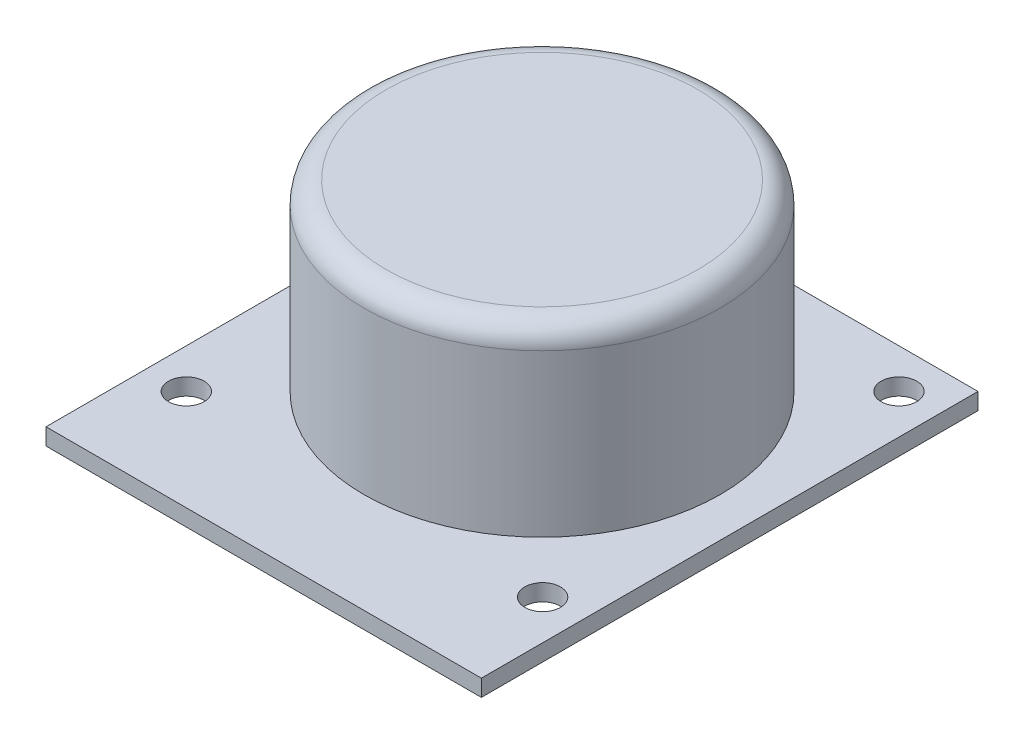
ISO-10303-21;
HEADER;
FILE_DESCRIPTION(('STEP AP214'),'2;1');
FILE_NAME('part.step','',(''),(''),'','','');
FILE_SCHEMA(('AUTOMOTIVE_DESIGN { 1 0 10303 214 1 1 1 1 }'));
ENDSEC;
DATA;
#1=APPLICATION_CONTEXT('core data for automotive mechanical design processes');
#2=APPLICATION_PROTOCOL_DEFINITION('international standard','automotive_design',2000,#1);
#3=PRODUCT_CONTEXT('',#1,'mechanical');
#4=PRODUCT('Part','Part','',(#3));
#5=PRODUCT_RELATED_PRODUCT_CATEGORY('part','',(#4));
#6=PRODUCT_DEFINITION_FORMATION('','',#4);
#7=PRODUCT_DEFINITION_CONTEXT('part definition',#1,'design');
#8=PRODUCT_DEFINITION('design','',#6,#7);
#9=PRODUCT_DEFINITION_SHAPE('','',#8);
#10=(LENGTH_UNIT() NAMED_UNIT(*) SI_UNIT(.MILLI.,.METRE.));
#11=(NAMED_UNIT(*) PLANE_ANGLE_UNIT() SI_UNIT($,.RADIAN.));
#12=(NAMED_UNIT(*) SI_UNIT($,.STERADIAN.) SOLID_ANGLE_UNIT());
#13=UNCERTAINTY_MEASURE_WITH_UNIT(LENGTH_MEASURE(1.E-05),#10,'distance_accuracy_value','');
#14=(GEOMETRIC_REPRESENTATION_CONTEXT(3) GLOBAL_UNCERTAINTY_ASSIGNED_CONTEXT((#13)) GLOBAL_UNIT_ASSIGNED_CONTEXT((#10,
#11,#12)) REPRESENTATION_CONTEXT('',''));
#15=CARTESIAN_POINT('',(0.,0.,0.));
#16=DIRECTION('',(0.,0.,1.));
#17=DIRECTION('',(1.,0.,0.));
#18=AXIS2_PLACEMENT_3D('',#15,#16,#17);
#19=CARTESIAN_POINT('',(39.1,1.5,0.));
#20=DIRECTION('',(0.,0.,-1.));
#21=DIRECTION('',(-1.,0.,0.));
#22=AXIS2_PLACEMENT_3D('',#19,#20,#21);
#23=PLANE('',#22);
#24=DIRECTION('',(1.,0.,0.));
#25=VECTOR('',#24,1.);
#26=CARTESIAN_POINT('',(39.1,0.,0.));
#27=LINE('',#26,#25);
#28=CARTESIAN_POINT('',(0.,0.,0.));
#29=VERTEX_POINT('',#28);
#30=CARTESIAN_POINT('',(39.1,0.,0.));
#31=VERTEX_POINT('',#30);
#32=EDGE_CURVE('E101',#29,#31,#27,.T.);
#33=ORIENTED_EDGE('',*,*,#32,.T.);
#34=DIRECTION('',(0.,-1.,0.));
#35=VECTOR('',#34,1.);
#36=CARTESIAN_POINT('',(39.1,1.5,0.));
#37=LINE('',#36,#35);
#38=CARTESIAN_POINT('',(39.1,1.5,0.));
#39=VERTEX_POINT('',#38);
#40=EDGE_CURVE('E92',#39,#31,#37,.T.);
#41=ORIENTED_EDGE('',*,*,#40,.F.);
#42=DIRECTION('',(1.,0.,0.));
#43=VECTOR('',#42,1.);
#44=CARTESIAN_POINT('',(39.1,1.5,0.));
#45=LINE('',#44,#43);
#46=CARTESIAN_POINT('',(0.,1.5,0.));
#47=VERTEX_POINT('',#46);
#48=EDGE_CURVE('E86',#47,#39,#45,.T.);
#49=ORIENTED_EDGE('',*,*,#48,.F.);
#50=DIRECTION('',(0.,-1.,0.));
#51=VECTOR('',#50,1.);
#52=CARTESIAN_POINT('',(0.,1.5,0.));
#53=LINE('',#52,#51);
#54=EDGE_CURVE('E97',#47,#29,#53,.T.);
#55=ORIENTED_EDGE('',*,*,#54,.T.);
#56=EDGE_LOOP('',(#33,#41,#49,#55));
#57=FACE_BOUND('',#56,.T.);
#58=ADVANCED_FACE('F33',(#57),#23,.F.);
#59=CARTESIAN_POINT('',(39.1,1.5,-44.6));
#60=DIRECTION('',(-1.,0.,0.));
#61=DIRECTION('',(0.,0.,1.));
#62=AXIS2_PLACEMENT_3D('',#59,#60,#61);
#63=PLANE('',#62);
#64=DIRECTION('',(0.,0.,-1.));
#65=VECTOR('',#64,1.);
#66=CARTESIAN_POINT('',(39.1,0.,-44.6));
#67=LINE('',#66,#65);
#68=CARTESIAN_POINT('',(39.1,0.,-44.6));
#69=VERTEX_POINT('',#68);
#70=EDGE_CURVE('E91',#31,#69,#67,.T.);
#71=ORIENTED_EDGE('',*,*,#70,.T.);
#72=DIRECTION('',(0.,-1.,0.));
#73=VECTOR('',#72,1.);
#74=CARTESIAN_POINT('',(39.1,1.5,-44.6));
#75=LINE('',#74,#73);
#76=CARTESIAN_POINT('',(39.1,1.5,-44.6));
#77=VERTEX_POINT('',#76);
#78=EDGE_CURVE('E89',#77,#69,#75,.T.);
#79=ORIENTED_EDGE('',*,*,#78,.F.);
#80=DIRECTION('',(0.,0.,-1.));
#81=VECTOR('',#80,1.);
#82=CARTESIAN_POINT('',(39.1,1.5,-44.6));
#83=LINE('',#82,#81);
#84=EDGE_CURVE('E81',#39,#77,#83,.T.);
#85=ORIENTED_EDGE('',*,*,#84,.F.);
#86=ORIENTED_EDGE('',*,*,#40,.T.);
#87=EDGE_LOOP('',(#71,#79,#85,#86));
#88=FACE_BOUND('',#87,.T.);
#89=ADVANCED_FACE('F90',(#88),#63,.F.);
#90=CARTESIAN_POINT('',(0.,1.5,-44.6));
#91=DIRECTION('',(0.,0.,1.));
#92=DIRECTION('',(1.,0.,0.));
#93=AXIS2_PLACEMENT_3D('',#90,#91,#92);
#94=PLANE('',#93);
#95=DIRECTION('',(-1.,0.,0.));
#96=VECTOR('',#95,1.);
#97=CARTESIAN_POINT('',(0.,0.,-44.6));
#98=LINE('',#97,#96);
#99=CARTESIAN_POINT('',(0.,0.,-44.6));
#100=VERTEX_POINT('',#99);
#101=EDGE_CURVE('E67',#69,#100,#98,.T.);
#102=ORIENTED_EDGE('',*,*,#101,.T.);
#103=DIRECTION('',(0.,-1.,0.));
#104=VECTOR('',#103,1.);
#105=CARTESIAN_POINT('',(0.,1.5,-44.6));
#106=LINE('',#105,#104);
#107=CARTESIAN_POINT('',(0.,1.5,-44.6));
#108=VERTEX_POINT('',#107);
#109=EDGE_CURVE('E93',#108,#100,#106,.T.);
#110=ORIENTED_EDGE('',*,*,#109,.F.);
#111=DIRECTION('',(-1.,0.,0.));
#112=VECTOR('',#111,1.);
#113=CARTESIAN_POINT('',(0.,1.5,-44.6));
#114=LINE('',#113,#112);
#115=EDGE_CURVE('E84',#77,#108,#114,.T.);
#116=ORIENTED_EDGE('',*,*,#115,.F.);
#117=ORIENTED_EDGE('',*,*,#78,.T.);
#118=EDGE_LOOP('',(#102,#110,#116,#117));
#119=FACE_BOUND('',#118,.T.);
#120=ADVANCED_FACE('F95',(#119),#94,.F.);
#121=CARTESIAN_POINT('',(0.,1.5,0.));
#122=DIRECTION('',(1.,0.,0.));
#123=DIRECTION('',(0.,0.,-1.));
#124=AXIS2_PLACEMENT_3D('',#121,#122,#123);
#125=PLANE('',#124);
#126=DIRECTION('',(0.,0.,1.));
#127=VECTOR('',#126,1.);
#128=CARTESIAN_POINT('',(0.,0.,0.));
#129=LINE('',#128,#127);
#130=EDGE_CURVE('E73',#100,#29,#129,.T.);
#131=ORIENTED_EDGE('',*,*,#130,.T.);
#132=ORIENTED_EDGE('',*,*,#54,.F.);
#133=DIRECTION('',(0.,0.,1.));
#134=VECTOR('',#133,1.);
#135=CARTESIAN_POINT('',(0.,1.5,0.));
#136=LINE('',#135,#134);
#137=EDGE_CURVE('E50',#108,#47,#136,.T.);
#138=ORIENTED_EDGE('',*,*,#137,.F.);
#139=ORIENTED_EDGE('',*,*,#109,.T.);
#140=EDGE_LOOP('',(#131,#132,#138,#139));
#141=FACE_BOUND('',#140,.T.);
#142=ADVANCED_FACE('F135',(#141),#125,.F.);
#143=CARTESIAN_POINT('',(0.,1.5,0.));
#144=DIRECTION('',(0.,-1.,0.));
#145=DIRECTION('',(0.,0.,-1.));
#146=AXIS2_PLACEMENT_3D('',#143,#144,#145);
#147=PLANE('',#146);
#148=CARTESIAN_POINT('',(19.55,1.5,-25.));
#149=DIRECTION('',(0.,-1.,0.));
#150=DIRECTION('',(0.,0.,-1.));
#151=AXIS2_PLACEMENT_3D('',#148,#149,#150);
#152=CIRCLE('',#151,16.);
#153=CARTESIAN_POINT('',(19.55,1.5,-41.));
#154=VERTEX_POINT('',#153);
#155=EDGE_CURVE('E111',#154,#154,#152,.F.);
#156=ORIENTED_EDGE('',*,*,#155,.F.);
#157=EDGE_LOOP('',(#156));
#158=FACE_BOUND('',#157,.T.);
#159=CARTESIAN_POINT('',(3.55,1.5,-9.05));
#160=DIRECTION('',(0.,1.,0.));
#161=DIRECTION('',(0.,0.,-1.));
#162=AXIS2_PLACEMENT_3D('',#159,#160,#161);
#163=CIRCLE('',#162,1.6);
#164=CARTESIAN_POINT('',(3.55,1.5,-10.65));
#165=VERTEX_POINT('',#164);
#166=EDGE_CURVE('E171',#165,#165,#163,.T.);
#167=ORIENTED_EDGE('',*,*,#166,.F.);
#168=EDGE_LOOP('',(#167));
#169=FACE_BOUND('',#168,.T.);
#170=CARTESIAN_POINT('',(3.54999999999999,1.5,-41.05));
#171=DIRECTION('',(0.,1.,0.));
#172=DIRECTION('',(0.,0.,1.));
#173=AXIS2_PLACEMENT_3D('',#170,#171,#172);
#174=CIRCLE('',#173,1.6);
#175=CARTESIAN_POINT('',(3.54999999999999,1.5,-39.45));
#176=VERTEX_POINT('',#175);
#177=EDGE_CURVE('E175',#176,#176,#174,.T.);
#178=ORIENTED_EDGE('',*,*,#177,.F.);
#179=EDGE_LOOP('',(#178));
#180=FACE_BOUND('',#179,.T.);
#181=CARTESIAN_POINT('',(35.55,1.5,-41.05));
#182=DIRECTION('',(0.,1.,0.));
#183=DIRECTION('',(0.,0.,-1.));
#184=AXIS2_PLACEMENT_3D('',#181,#182,#183);
#185=CIRCLE('',#184,1.6);
#186=CARTESIAN_POINT('',(35.55,1.5,-42.65));
#187=VERTEX_POINT('',#186);
#188=EDGE_CURVE('E179',#187,#187,#185,.T.);
#189=ORIENTED_EDGE('',*,*,#188,.F.);
#190=EDGE_LOOP('',(#189));
#191=FACE_BOUND('',#190,.T.);
#192=CARTESIAN_POINT('',(35.55,1.5,-9.05));
#193=DIRECTION('',(0.,1.,0.));
#194=DIRECTION('',(0.,0.,1.));
#195=AXIS2_PLACEMENT_3D('',#192,#193,#194);
#196=CIRCLE('',#195,1.6);
#197=CARTESIAN_POINT('',(35.55,1.5,-7.45));
#198=VERTEX_POINT('',#197);
#199=EDGE_CURVE('E182',#198,#198,#196,.T.);
#200=ORIENTED_EDGE('',*,*,#199,.F.);
#201=EDGE_LOOP('',(#200));
#202=FACE_BOUND('',#201,.T.);
#203=ORIENTED_EDGE('',*,*,#48,.T.);
#204=ORIENTED_EDGE('',*,*,#84,.T.);
#205=ORIENTED_EDGE('',*,*,#115,.T.);
#206=ORIENTED_EDGE('',*,*,#137,.T.);
#207=EDGE_LOOP('',(#203,#204,#205,#206));
#208=FACE_BOUND('',#207,.T.);
#209=ADVANCED_FACE('F82',(#158,#169,#180,#191,#202,#208),#147,.F.);
#210=CARTESIAN_POINT('',(0.,0.,0.));
#211=DIRECTION('',(0.,-1.,0.));
#212=DIRECTION('',(0.,0.,-1.));
#213=AXIS2_PLACEMENT_3D('',#210,#211,#212);
#214=PLANE('',#213);
#215=CARTESIAN_POINT('',(3.55,0.,-9.05));
#216=DIRECTION('',(0.,1.,0.));
#217=DIRECTION('',(0.,0.,-1.));
#218=AXIS2_PLACEMENT_3D('',#215,#216,#217);
#219=CIRCLE('',#218,1.6);
#220=CARTESIAN_POINT('',(3.55,0.,-10.65));
#221=VERTEX_POINT('',#220);
#222=EDGE_CURVE('E192',#221,#221,#219,.T.);
#223=ORIENTED_EDGE('',*,*,#222,.T.);
#224=EDGE_LOOP('',(#223));
#225=FACE_BOUND('',#224,.T.);
#226=CARTESIAN_POINT('',(3.54999999999999,0.,-41.05));
#227=DIRECTION('',(0.,1.,0.));
#228=DIRECTION('',(0.,0.,1.));
#229=AXIS2_PLACEMENT_3D('',#226,#227,#228);
#230=CIRCLE('',#229,1.6);
#231=CARTESIAN_POINT('',(3.54999999999999,0.,-39.45));
#232=VERTEX_POINT('',#231);
#233=EDGE_CURVE('E196',#232,#232,#230,.T.);
#234=ORIENTED_EDGE('',*,*,#233,.T.);
#235=EDGE_LOOP('',(#234));
#236=FACE_BOUND('',#235,.T.);
#237=CARTESIAN_POINT('',(35.55,0.,-41.05));
#238=DIRECTION('',(0.,1.,0.));
#239=DIRECTION('',(0.,0.,-1.));
#240=AXIS2_PLACEMENT_3D('',#237,#238,#239);
#241=CIRCLE('',#240,1.6);
#242=CARTESIAN_POINT('',(35.55,0.,-42.65));
#243=VERTEX_POINT('',#242);
#244=EDGE_CURVE('E184',#243,#243,#241,.T.);
#245=ORIENTED_EDGE('',*,*,#244,.T.);
#246=EDGE_LOOP('',(#245));
#247=FACE_BOUND('',#246,.T.);
#248=CARTESIAN_POINT('',(35.55,0.,-9.05));
#249=DIRECTION('',(0.,1.,0.));
#250=DIRECTION('',(0.,0.,1.));
#251=AXIS2_PLACEMENT_3D('',#248,#249,#250);
#252=CIRCLE('',#251,1.6);
#253=CARTESIAN_POINT('',(35.55,0.,-7.45));
#254=VERTEX_POINT('',#253);
#255=EDGE_CURVE('E104',#254,#254,#252,.T.);
#256=ORIENTED_EDGE('',*,*,#255,.T.);
#257=EDGE_LOOP('',(#256));
#258=FACE_BOUND('',#257,.T.);
#259=ORIENTED_EDGE('',*,*,#32,.F.);
#260=ORIENTED_EDGE('',*,*,#130,.F.);
#261=ORIENTED_EDGE('',*,*,#101,.F.);
#262=ORIENTED_EDGE('',*,*,#70,.F.);
#263=EDGE_LOOP('',(#259,#260,#261,#262));
#264=FACE_BOUND('',#263,.T.);
#265=ADVANCED_FACE('F138',(#225,#236,#247,#258,#264),#214,.T.);
#266=CARTESIAN_POINT('',(35.55,0.,-9.05));
#267=DIRECTION('',(0.,1.,0.));
#268=DIRECTION('',(0.,0.,1.));
#269=AXIS2_PLACEMENT_3D('',#266,#267,#268);
#270=CYLINDRICAL_SURFACE('',#269,1.6);
#271=ORIENTED_EDGE('',*,*,#255,.F.);
#272=EDGE_LOOP('',(#271));
#273=FACE_BOUND('',#272,.T.);
#274=ORIENTED_EDGE('',*,*,#199,.T.);
#275=EDGE_LOOP('',(#274));
#276=FACE_BOUND('',#275,.T.);
#277=ADVANCED_FACE('F141',(#273,#276),#270,.F.);
#278=CARTESIAN_POINT('',(35.55,0.,-41.05));
#279=DIRECTION('',(0.,1.,0.));
#280=DIRECTION('',(0.,0.,1.));
#281=AXIS2_PLACEMENT_3D('',#278,#279,#280);
#282=CYLINDRICAL_SURFACE('',#281,1.6);
#283=ORIENTED_EDGE('',*,*,#244,.F.);
#284=EDGE_LOOP('',(#283));
#285=FACE_BOUND('',#284,.T.);
#286=ORIENTED_EDGE('',*,*,#188,.T.);
#287=EDGE_LOOP('',(#286));
#288=FACE_BOUND('',#287,.T.);
#289=ADVANCED_FACE('F148',(#285,#288),#282,.F.);
#290=CARTESIAN_POINT('',(3.54999999999999,0.,-41.05));
#291=DIRECTION('',(0.,1.,0.));
#292=DIRECTION('',(0.,0.,1.));
#293=AXIS2_PLACEMENT_3D('',#290,#291,#292);
#294=CYLINDRICAL_SURFACE('',#293,1.6);
#295=ORIENTED_EDGE('',*,*,#233,.F.);
#296=EDGE_LOOP('',(#295));
#297=FACE_BOUND('',#296,.T.);
#298=ORIENTED_EDGE('',*,*,#177,.T.);
#299=EDGE_LOOP('',(#298));
#300=FACE_BOUND('',#299,.T.);
#301=ADVANCED_FACE('F153',(#297,#300),#294,.F.);
#302=CARTESIAN_POINT('',(3.55,0.,-9.05));
#303=DIRECTION('',(0.,1.,0.));
#304=DIRECTION('',(0.,0.,1.));
#305=AXIS2_PLACEMENT_3D('',#302,#303,#304);
#306=CYLINDRICAL_SURFACE('',#305,1.6);
#307=ORIENTED_EDGE('',*,*,#222,.F.);
#308=EDGE_LOOP('',(#307));
#309=FACE_BOUND('',#308,.T.);
#310=ORIENTED_EDGE('',*,*,#166,.T.);
#311=EDGE_LOOP('',(#310));
#312=FACE_BOUND('',#311,.T.);
#313=ADVANCED_FACE('F150',(#309,#312),#306,.F.);
#314=CARTESIAN_POINT('',(19.55,18.,-25.));
#315=DIRECTION('',(0.,-1.,0.));
#316=DIRECTION('',(0.,0.,-1.));
#317=AXIS2_PLACEMENT_3D('',#314,#315,#316);
#318=CYLINDRICAL_SURFACE('',#317,16.);
#319=CARTESIAN_POINT('',(19.55,16.,-25.));
#320=DIRECTION('',(0.,1.,0.));
#321=DIRECTION('',(0.,0.,1.));
#322=AXIS2_PLACEMENT_3D('',#319,#320,#321);
#323=CIRCLE('',#322,16.);
#324=CARTESIAN_POINT('',(19.55,16.,-9.));
#325=VERTEX_POINT('',#324);
#326=EDGE_CURVE('E11',#325,#325,#323,.F.);
#327=ORIENTED_EDGE('',*,*,#326,.T.);
#328=EDGE_LOOP('',(#327));
#329=FACE_BOUND('',#328,.T.);
#330=ORIENTED_EDGE('',*,*,#155,.T.);
#331=EDGE_LOOP('',(#330));
#332=FACE_BOUND('',#331,.T.);
#333=ADVANCED_FACE('F123',(#329,#332),#318,.T.);
#334=CARTESIAN_POINT('',(19.55,18.,-25.));
#335=DIRECTION('',(0.,1.,0.));
#336=DIRECTION('',(0.,0.,1.));
#337=AXIS2_PLACEMENT_3D('',#334,#335,#336);
#338=PLANE('',#337);
#339=CARTESIAN_POINT('',(19.55,18.,-25.));
#340=DIRECTION('',(0.,1.,0.));
#341=DIRECTION('',(0.,0.,1.));
#342=AXIS2_PLACEMENT_3D('',#339,#340,#341);
#343=CIRCLE('',#342,14.);
#344=CARTESIAN_POINT('',(19.55,18.,-11.));
#345=VERTEX_POINT('',#344);
#346=EDGE_CURVE('E42',#345,#345,#343,.T.);
#347=ORIENTED_EDGE('',*,*,#346,.T.);
#348=EDGE_LOOP('',(#347));
#349=FACE_BOUND('',#348,.T.);
#350=ADVANCED_FACE('F116',(#349),#338,.T.);
#351=CARTESIAN_POINT('',(19.55,16.,-25.));
#352=DIRECTION('',(0.,1.,0.));
#353=DIRECTION('',(0.,0.,1.));
#354=AXIS2_PLACEMENT_3D('',#351,#352,#353);
#355=TOROIDAL_SURFACE('',#354,14.,2.);
#356=ORIENTED_EDGE('',*,*,#326,.F.);
#357=EDGE_LOOP('',(#356));
#358=FACE_BOUND('',#357,.T.);
#359=ORIENTED_EDGE('',*,*,#346,.F.);
#360=EDGE_LOOP('',(#359));
#361=FACE_BOUND('',#360,.T.);
#362=ADVANCED_FACE('F35',(#358,#361),#355,.T.);
#363=CLOSED_SHELL('',(#58,#89,#120,#142,#209,#265,#277,#289,#301,#313,#333,#350,#362));
#364=MANIFOLD_SOLID_BREP('B2',#363);
#365=ADVANCED_BREP_SHAPE_REPRESENTATION('',(#18,#364),#14);
#366=SHAPE_DEFINITION_REPRESENTATION(#9,#365);
ENDSEC;
END-ISO-10303-21;
